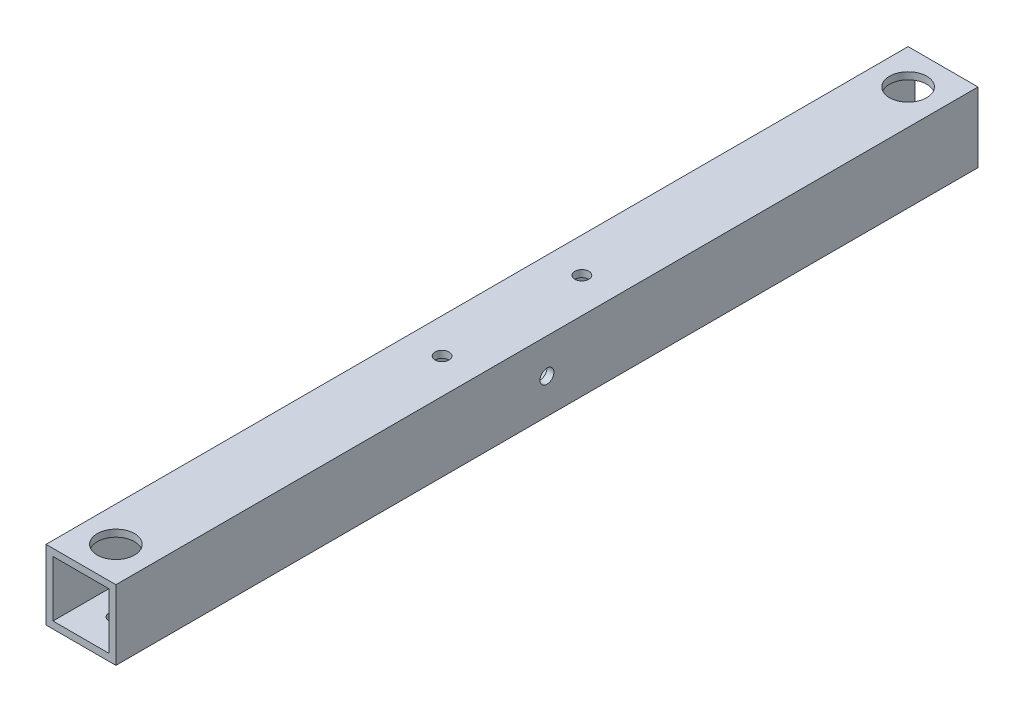
ISO-10303-21;
HEADER;
FILE_DESCRIPTION(('STEP AP214'),'2;1');
FILE_NAME('part.step','',(''),(''),'','','');
FILE_SCHEMA(('AUTOMOTIVE_DESIGN { 1 0 10303 214 1 1 1 1 }'));
ENDSEC;
DATA;
#1=APPLICATION_CONTEXT('core data for automotive mechanical design processes');
#2=APPLICATION_PROTOCOL_DEFINITION('international standard','automotive_design',2000,#1);
#3=PRODUCT_CONTEXT('',#1,'mechanical');
#4=PRODUCT('Part','Part','',(#3));
#5=PRODUCT_RELATED_PRODUCT_CATEGORY('part','',(#4));
#6=PRODUCT_DEFINITION_FORMATION('','',#4);
#7=PRODUCT_DEFINITION_CONTEXT('part definition',#1,'design');
#8=PRODUCT_DEFINITION('design','',#6,#7);
#9=PRODUCT_DEFINITION_SHAPE('','',#8);
#10=(LENGTH_UNIT() NAMED_UNIT(*) SI_UNIT(.MILLI.,.METRE.));
#11=(NAMED_UNIT(*) PLANE_ANGLE_UNIT() SI_UNIT($,.RADIAN.));
#12=(NAMED_UNIT(*) SI_UNIT($,.STERADIAN.) SOLID_ANGLE_UNIT());
#13=UNCERTAINTY_MEASURE_WITH_UNIT(LENGTH_MEASURE(1.E-05),#10,'distance_accuracy_value','');
#14=(GEOMETRIC_REPRESENTATION_CONTEXT(3) GLOBAL_UNCERTAINTY_ASSIGNED_CONTEXT((#13)) GLOBAL_UNIT_ASSIGNED_CONTEXT((#10,
#11,#12)) REPRESENTATION_CONTEXT('',''));
#15=CARTESIAN_POINT('',(0.,0.,0.));
#16=DIRECTION('',(0.,0.,1.));
#17=DIRECTION('',(1.,0.,0.));
#18=AXIS2_PLACEMENT_3D('',#15,#16,#17);
#19=CARTESIAN_POINT('',(0.,0.,185.));
#20=DIRECTION('',(0.,0.,1.));
#21=DIRECTION('',(1.,0.,0.));
#22=AXIS2_PLACEMENT_3D('',#19,#20,#21);
#23=PLANE('',#22);
#24=DIRECTION('',(0.,-1.,0.));
#25=VECTOR('',#24,1.);
#26=CARTESIAN_POINT('',(-7.01008414074451,7.73262608579252,185.));
#27=LINE('',#26,#25);
#28=CARTESIAN_POINT('',(-7.01008414074451,7.73262608579252,185.));
#29=VERTEX_POINT('',#28);
#30=CARTESIAN_POINT('',(-7.01008414074451,-7.26737391420748,185.));
#31=VERTEX_POINT('',#30);
#32=EDGE_CURVE('E139',#29,#31,#27,.T.);
#33=ORIENTED_EDGE('',*,*,#32,.T.);
#34=DIRECTION('',(1.,0.,0.));
#35=VECTOR('',#34,1.);
#36=CARTESIAN_POINT('',(-7.01008414074451,-7.26737391420748,185.));
#37=LINE('',#36,#35);
#38=CARTESIAN_POINT('',(7.98991585925548,-7.26737391420748,185.));
#39=VERTEX_POINT('',#38);
#40=EDGE_CURVE('E142',#31,#39,#37,.T.);
#41=ORIENTED_EDGE('',*,*,#40,.T.);
#42=DIRECTION('',(0.,1.,0.));
#43=VECTOR('',#42,1.);
#44=CARTESIAN_POINT('',(7.98991585925549,7.73262608579252,185.));
#45=LINE('',#44,#43);
#46=CARTESIAN_POINT('',(7.98991585925549,7.73262608579252,185.));
#47=VERTEX_POINT('',#46);
#48=EDGE_CURVE('E145',#39,#47,#45,.T.);
#49=ORIENTED_EDGE('',*,*,#48,.T.);
#50=DIRECTION('',(-1.,0.,0.));
#51=VECTOR('',#50,1.);
#52=CARTESIAN_POINT('',(-7.01008414074451,7.73262608579252,185.));
#53=LINE('',#52,#51);
#54=EDGE_CURVE('E147',#47,#29,#53,.T.);
#55=ORIENTED_EDGE('',*,*,#54,.T.);
#56=EDGE_LOOP('',(#33,#41,#49,#55));
#57=FACE_BOUND('',#56,.T.);
#58=DIRECTION('',(1.,0.,0.));
#59=VECTOR('',#58,1.);
#60=CARTESIAN_POINT('',(-5.51008414074451,-5.76737391420748,185.));
#61=LINE('',#60,#59);
#62=CARTESIAN_POINT('',(-5.51008414074451,-5.76737391420748,185.));
#63=VERTEX_POINT('',#62);
#64=CARTESIAN_POINT('',(6.48991585925549,-5.76737391420748,185.));
#65=VERTEX_POINT('',#64);
#66=EDGE_CURVE('E109',#63,#65,#61,.T.);
#67=ORIENTED_EDGE('',*,*,#66,.F.);
#68=DIRECTION('',(0.,-1.,0.));
#69=VECTOR('',#68,1.);
#70=CARTESIAN_POINT('',(-5.51008414074451,6.23262608579252,185.));
#71=LINE('',#70,#69);
#72=CARTESIAN_POINT('',(-5.51008414074451,6.23262608579252,185.));
#73=VERTEX_POINT('',#72);
#74=EDGE_CURVE('E101',#73,#63,#71,.T.);
#75=ORIENTED_EDGE('',*,*,#74,.F.);
#76=DIRECTION('',(-1.,0.,0.));
#77=VECTOR('',#76,1.);
#78=CARTESIAN_POINT('',(-5.51008414074451,6.23262608579252,185.));
#79=LINE('',#78,#77);
#80=CARTESIAN_POINT('',(6.48991585925549,6.23262608579252,185.));
#81=VERTEX_POINT('',#80);
#82=EDGE_CURVE('E123',#81,#73,#79,.T.);
#83=ORIENTED_EDGE('',*,*,#82,.F.);
#84=DIRECTION('',(0.,1.,0.));
#85=VECTOR('',#84,1.);
#86=CARTESIAN_POINT('',(6.48991585925549,6.23262608579252,185.));
#87=LINE('',#86,#85);
#88=EDGE_CURVE('E121',#65,#81,#87,.T.);
#89=ORIENTED_EDGE('',*,*,#88,.F.);
#90=EDGE_LOOP('',(#67,#75,#83,#89));
#91=FACE_BOUND('',#90,.T.);
#92=ADVANCED_FACE('F34',(#57,#91),#23,.T.);
#93=CARTESIAN_POINT('',(0.,0.,0.));
#94=DIRECTION('',(0.,0.,1.));
#95=DIRECTION('',(1.,0.,0.));
#96=AXIS2_PLACEMENT_3D('',#93,#94,#95);
#97=PLANE('',#96);
#98=DIRECTION('',(0.,-1.,0.));
#99=VECTOR('',#98,1.);
#100=CARTESIAN_POINT('',(-7.01008414074451,7.73262608579252,0.));
#101=LINE('',#100,#99);
#102=CARTESIAN_POINT('',(-7.01008414074451,7.73262608579252,0.));
#103=VERTEX_POINT('',#102);
#104=CARTESIAN_POINT('',(-7.01008414074451,-7.26737391420748,0.));
#105=VERTEX_POINT('',#104);
#106=EDGE_CURVE('E117',#103,#105,#101,.T.);
#107=ORIENTED_EDGE('',*,*,#106,.F.);
#108=DIRECTION('',(-1.,0.,0.));
#109=VECTOR('',#108,1.);
#110=CARTESIAN_POINT('',(-7.01008414074451,7.73262608579252,0.));
#111=LINE('',#110,#109);
#112=CARTESIAN_POINT('',(7.98991585925549,7.73262608579252,0.));
#113=VERTEX_POINT('',#112);
#114=EDGE_CURVE('E143',#113,#103,#111,.T.);
#115=ORIENTED_EDGE('',*,*,#114,.F.);
#116=DIRECTION('',(0.,1.,0.));
#117=VECTOR('',#116,1.);
#118=CARTESIAN_POINT('',(7.98991585925549,7.73262608579252,0.));
#119=LINE('',#118,#117);
#120=CARTESIAN_POINT('',(7.98991585925548,-7.26737391420748,0.));
#121=VERTEX_POINT('',#120);
#122=EDGE_CURVE('E154',#121,#113,#119,.T.);
#123=ORIENTED_EDGE('',*,*,#122,.F.);
#124=DIRECTION('',(1.,0.,0.));
#125=VECTOR('',#124,1.);
#126=CARTESIAN_POINT('',(-7.01008414074451,-7.26737391420748,0.));
#127=LINE('',#126,#125);
#128=EDGE_CURVE('E152',#105,#121,#127,.T.);
#129=ORIENTED_EDGE('',*,*,#128,.F.);
#130=EDGE_LOOP('',(#107,#115,#123,#129));
#131=FACE_BOUND('',#130,.T.);
#132=DIRECTION('',(0.,-1.,0.));
#133=VECTOR('',#132,1.);
#134=CARTESIAN_POINT('',(-5.51008414074451,6.23262608579252,0.));
#135=LINE('',#134,#133);
#136=CARTESIAN_POINT('',(-5.51008414074451,6.23262608579252,0.));
#137=VERTEX_POINT('',#136);
#138=CARTESIAN_POINT('',(-5.51008414074451,-5.76737391420748,0.));
#139=VERTEX_POINT('',#138);
#140=EDGE_CURVE('E59',#137,#139,#135,.T.);
#141=ORIENTED_EDGE('',*,*,#140,.T.);
#142=DIRECTION('',(1.,0.,0.));
#143=VECTOR('',#142,1.);
#144=CARTESIAN_POINT('',(-5.51008414074451,-5.76737391420748,0.));
#145=LINE('',#144,#143);
#146=CARTESIAN_POINT('',(6.48991585925549,-5.76737391420748,0.));
#147=VERTEX_POINT('',#146);
#148=EDGE_CURVE('E116',#139,#147,#145,.T.);
#149=ORIENTED_EDGE('',*,*,#148,.T.);
#150=DIRECTION('',(0.,1.,0.));
#151=VECTOR('',#150,1.);
#152=CARTESIAN_POINT('',(6.48991585925549,6.23262608579252,0.));
#153=LINE('',#152,#151);
#154=CARTESIAN_POINT('',(6.48991585925549,6.23262608579252,0.));
#155=VERTEX_POINT('',#154);
#156=EDGE_CURVE('E131',#147,#155,#153,.T.);
#157=ORIENTED_EDGE('',*,*,#156,.T.);
#158=DIRECTION('',(-1.,0.,0.));
#159=VECTOR('',#158,1.);
#160=CARTESIAN_POINT('',(-5.51008414074451,6.23262608579252,0.));
#161=LINE('',#160,#159);
#162=EDGE_CURVE('E110',#155,#137,#161,.T.);
#163=ORIENTED_EDGE('',*,*,#162,.T.);
#164=EDGE_LOOP('',(#141,#149,#157,#163));
#165=FACE_BOUND('',#164,.T.);
#166=ADVANCED_FACE('F241',(#131,#165),#97,.F.);
#167=CARTESIAN_POINT('',(-7.01008414074451,7.73262608579252,185.));
#168=DIRECTION('',(1.,0.,0.));
#169=DIRECTION('',(0.,1.,0.));
#170=AXIS2_PLACEMENT_3D('',#167,#168,#169);
#171=PLANE('',#170);
#172=CARTESIAN_POINT('',(-7.01008414074451,0.232626085792502,92.5));
#173=DIRECTION('',(-1.,0.,0.));
#174=DIRECTION('',(0.,-1.,0.));
#175=AXIS2_PLACEMENT_3D('',#172,#173,#174);
#176=CIRCLE('',#175,4.00000000000001);
#177=CARTESIAN_POINT('',(-7.01008414074451,-3.7673739142075,92.5));
#178=VERTEX_POINT('',#177);
#179=EDGE_CURVE('E206',#178,#178,#176,.T.);
#180=ORIENTED_EDGE('',*,*,#179,.F.);
#181=EDGE_LOOP('',(#180));
#182=FACE_BOUND('',#181,.T.);
#183=ORIENTED_EDGE('',*,*,#106,.T.);
#184=DIRECTION('',(0.,0.,-1.));
#185=VECTOR('',#184,1.);
#186=CARTESIAN_POINT('',(-7.01008414074451,-7.26737391420748,185.));
#187=LINE('',#186,#185);
#188=EDGE_CURVE('E11',#31,#105,#187,.T.);
#189=ORIENTED_EDGE('',*,*,#188,.F.);
#190=ORIENTED_EDGE('',*,*,#32,.F.);
#191=DIRECTION('',(0.,0.,-1.));
#192=VECTOR('',#191,1.);
#193=CARTESIAN_POINT('',(-7.01008414074451,7.73262608579252,185.));
#194=LINE('',#193,#192);
#195=EDGE_CURVE('E149',#29,#103,#194,.T.);
#196=ORIENTED_EDGE('',*,*,#195,.T.);
#197=EDGE_LOOP('',(#183,#189,#190,#196));
#198=FACE_BOUND('',#197,.T.);
#199=ADVANCED_FACE('F36',(#182,#198),#171,.F.);
#200=CARTESIAN_POINT('',(-7.01008414074451,-7.26737391420748,185.));
#201=DIRECTION('',(0.,1.,0.));
#202=DIRECTION('',(0.,0.,1.));
#203=AXIS2_PLACEMENT_3D('',#200,#201,#202);
#204=PLANE('',#203);
#205=CARTESIAN_POINT('',(0.489915859255476,-7.26737391420748,107.5));
#206=DIRECTION('',(0.,-1.,0.));
#207=DIRECTION('',(0.,0.,-1.));
#208=AXIS2_PLACEMENT_3D('',#205,#206,#207);
#209=CIRCLE('',#208,4.);
#210=CARTESIAN_POINT('',(0.489915859255476,-7.26737391420748,103.5));
#211=VERTEX_POINT('',#210);
#212=EDGE_CURVE('E193',#211,#211,#209,.T.);
#213=ORIENTED_EDGE('',*,*,#212,.F.);
#214=EDGE_LOOP('',(#213));
#215=FACE_BOUND('',#214,.T.);
#216=CARTESIAN_POINT('',(0.489915859255473,-7.26737391420748,77.5));
#217=DIRECTION('',(0.,-1.,0.));
#218=DIRECTION('',(0.,0.,-1.));
#219=AXIS2_PLACEMENT_3D('',#216,#217,#218);
#220=CIRCLE('',#219,4.);
#221=CARTESIAN_POINT('',(0.489915859255473,-7.26737391420748,73.5));
#222=VERTEX_POINT('',#221);
#223=EDGE_CURVE('E190',#222,#222,#220,.T.);
#224=ORIENTED_EDGE('',*,*,#223,.F.);
#225=EDGE_LOOP('',(#224));
#226=FACE_BOUND('',#225,.T.);
#227=CARTESIAN_POINT('',(0.489915859255484,-7.26737391420748,177.5));
#228=DIRECTION('',(0.,-1.,0.));
#229=DIRECTION('',(0.,0.,-1.));
#230=AXIS2_PLACEMENT_3D('',#227,#228,#229);
#231=CIRCLE('',#230,1.5);
#232=CARTESIAN_POINT('',(0.489915859255484,-7.26737391420748,176.));
#233=VERTEX_POINT('',#232);
#234=EDGE_CURVE('E178',#233,#233,#231,.T.);
#235=ORIENTED_EDGE('',*,*,#234,.F.);
#236=EDGE_LOOP('',(#235));
#237=FACE_BOUND('',#236,.T.);
#238=CARTESIAN_POINT('',(0.489915859255484,-7.26737391420748,7.5));
#239=DIRECTION('',(0.,-1.,0.));
#240=DIRECTION('',(0.,0.,-1.));
#241=AXIS2_PLACEMENT_3D('',#238,#239,#240);
#242=CIRCLE('',#241,1.5);
#243=CARTESIAN_POINT('',(0.489915859255484,-7.26737391420748,6.));
#244=VERTEX_POINT('',#243);
#245=EDGE_CURVE('E174',#244,#244,#242,.T.);
#246=ORIENTED_EDGE('',*,*,#245,.F.);
#247=EDGE_LOOP('',(#246));
#248=FACE_BOUND('',#247,.T.);
#249=ORIENTED_EDGE('',*,*,#128,.T.);
#250=DIRECTION('',(0.,0.,-1.));
#251=VECTOR('',#250,1.);
#252=CARTESIAN_POINT('',(7.98991585925548,-7.26737391420748,185.));
#253=LINE('',#252,#251);
#254=EDGE_CURVE('E43',#39,#121,#253,.T.);
#255=ORIENTED_EDGE('',*,*,#254,.F.);
#256=ORIENTED_EDGE('',*,*,#40,.F.);
#257=ORIENTED_EDGE('',*,*,#188,.T.);
#258=EDGE_LOOP('',(#249,#255,#256,#257));
#259=FACE_BOUND('',#258,.T.);
#260=ADVANCED_FACE('F245',(#215,#226,#237,#248,#259),#204,.F.);
#261=CARTESIAN_POINT('',(7.98991585925549,7.73262608579252,185.));
#262=DIRECTION('',(-1.,0.,0.));
#263=DIRECTION('',(0.,-1.,0.));
#264=AXIS2_PLACEMENT_3D('',#261,#262,#263);
#265=PLANE('',#264);
#266=CARTESIAN_POINT('',(7.98991585925548,0.232626085792525,92.5));
#267=DIRECTION('',(1.,0.,0.));
#268=DIRECTION('',(0.,1.,0.));
#269=AXIS2_PLACEMENT_3D('',#266,#267,#268);
#270=CIRCLE('',#269,1.5);
#271=CARTESIAN_POINT('',(7.98991585925548,1.73262608579252,92.5));
#272=VERTEX_POINT('',#271);
#273=EDGE_CURVE('E196',#272,#272,#270,.T.);
#274=ORIENTED_EDGE('',*,*,#273,.F.);
#275=EDGE_LOOP('',(#274));
#276=FACE_BOUND('',#275,.T.);
#277=ORIENTED_EDGE('',*,*,#122,.T.);
#278=DIRECTION('',(0.,0.,-1.));
#279=VECTOR('',#278,1.);
#280=CARTESIAN_POINT('',(7.98991585925549,7.73262608579252,185.));
#281=LINE('',#280,#279);
#282=EDGE_CURVE('E159',#47,#113,#281,.T.);
#283=ORIENTED_EDGE('',*,*,#282,.F.);
#284=ORIENTED_EDGE('',*,*,#48,.F.);
#285=ORIENTED_EDGE('',*,*,#254,.T.);
#286=EDGE_LOOP('',(#277,#283,#284,#285));
#287=FACE_BOUND('',#286,.T.);
#288=ADVANCED_FACE('F228',(#276,#287),#265,.F.);
#289=CARTESIAN_POINT('',(-7.01008414074451,7.73262608579252,185.));
#290=DIRECTION('',(0.,-1.,0.));
#291=DIRECTION('',(0.,0.,-1.));
#292=AXIS2_PLACEMENT_3D('',#289,#290,#291);
#293=PLANE('',#292);
#294=CARTESIAN_POINT('',(0.489915859255486,7.73262608579252,107.5));
#295=DIRECTION('',(0.,1.,0.));
#296=DIRECTION('',(0.,0.,1.));
#297=AXIS2_PLACEMENT_3D('',#294,#295,#296);
#298=CIRCLE('',#297,1.5);
#299=CARTESIAN_POINT('',(0.489915859255486,7.73262608579252,109.));
#300=VERTEX_POINT('',#299);
#301=EDGE_CURVE('E186',#300,#300,#298,.T.);
#302=ORIENTED_EDGE('',*,*,#301,.F.);
#303=EDGE_LOOP('',(#302));
#304=FACE_BOUND('',#303,.T.);
#305=CARTESIAN_POINT('',(0.489915859255467,7.73262608579252,77.5));
#306=DIRECTION('',(0.,1.,0.));
#307=DIRECTION('',(0.,0.,1.));
#308=AXIS2_PLACEMENT_3D('',#305,#306,#307);
#309=CIRCLE('',#308,1.5);
#310=CARTESIAN_POINT('',(0.489915859255467,7.73262608579252,79.));
#311=VERTEX_POINT('',#310);
#312=EDGE_CURVE('E182',#311,#311,#309,.T.);
#313=ORIENTED_EDGE('',*,*,#312,.F.);
#314=EDGE_LOOP('',(#313));
#315=FACE_BOUND('',#314,.T.);
#316=CARTESIAN_POINT('',(0.489915859255487,7.73262608579252,177.5));
#317=DIRECTION('',(0.,1.,0.));
#318=DIRECTION('',(0.,0.,1.));
#319=AXIS2_PLACEMENT_3D('',#316,#317,#318);
#320=CIRCLE('',#319,4.);
#321=CARTESIAN_POINT('',(0.489915859255487,7.73262608579252,181.5));
#322=VERTEX_POINT('',#321);
#323=EDGE_CURVE('E170',#322,#322,#320,.T.);
#324=ORIENTED_EDGE('',*,*,#323,.F.);
#325=EDGE_LOOP('',(#324));
#326=FACE_BOUND('',#325,.T.);
#327=CARTESIAN_POINT('',(0.489915859255487,7.73262608579252,7.5));
#328=DIRECTION('',(0.,1.,0.));
#329=DIRECTION('',(0.,0.,1.));
#330=AXIS2_PLACEMENT_3D('',#327,#328,#329);
#331=CIRCLE('',#330,4.);
#332=CARTESIAN_POINT('',(0.489915859255487,7.73262608579252,11.5));
#333=VERTEX_POINT('',#332);
#334=EDGE_CURVE('E166',#333,#333,#331,.T.);
#335=ORIENTED_EDGE('',*,*,#334,.F.);
#336=EDGE_LOOP('',(#335));
#337=FACE_BOUND('',#336,.T.);
#338=ORIENTED_EDGE('',*,*,#114,.T.);
#339=ORIENTED_EDGE('',*,*,#195,.F.);
#340=ORIENTED_EDGE('',*,*,#54,.F.);
#341=ORIENTED_EDGE('',*,*,#282,.T.);
#342=EDGE_LOOP('',(#338,#339,#340,#341));
#343=FACE_BOUND('',#342,.T.);
#344=ADVANCED_FACE('F225',(#304,#315,#326,#337,#343),#293,.F.);
#345=CARTESIAN_POINT('',(-5.51008414074451,6.23262608579252,185.));
#346=DIRECTION('',(1.,0.,0.));
#347=DIRECTION('',(0.,1.,0.));
#348=AXIS2_PLACEMENT_3D('',#345,#346,#347);
#349=PLANE('',#348);
#350=CARTESIAN_POINT('',(-5.51008414074451,0.232626085792502,92.5));
#351=DIRECTION('',(1.,0.,0.));
#352=DIRECTION('',(0.,1.,0.));
#353=AXIS2_PLACEMENT_3D('',#350,#351,#352);
#354=CIRCLE('',#353,4.00000000000001);
#355=CARTESIAN_POINT('',(-5.51008414074451,4.23262608579251,92.5));
#356=VERTEX_POINT('',#355);
#357=EDGE_CURVE('E38',#356,#356,#354,.T.);
#358=ORIENTED_EDGE('',*,*,#357,.F.);
#359=EDGE_LOOP('',(#358));
#360=FACE_BOUND('',#359,.T.);
#361=ORIENTED_EDGE('',*,*,#140,.F.);
#362=DIRECTION('',(0.,0.,-1.));
#363=VECTOR('',#362,1.);
#364=CARTESIAN_POINT('',(-5.51008414074451,6.23262608579252,185.));
#365=LINE('',#364,#363);
#366=EDGE_CURVE('E105',#73,#137,#365,.T.);
#367=ORIENTED_EDGE('',*,*,#366,.F.);
#368=ORIENTED_EDGE('',*,*,#74,.T.);
#369=DIRECTION('',(0.,0.,-1.));
#370=VECTOR('',#369,1.);
#371=CARTESIAN_POINT('',(-5.51008414074451,-5.76737391420748,185.));
#372=LINE('',#371,#370);
#373=EDGE_CURVE('E104',#63,#139,#372,.T.);
#374=ORIENTED_EDGE('',*,*,#373,.T.);
#375=EDGE_LOOP('',(#361,#367,#368,#374));
#376=FACE_BOUND('',#375,.T.);
#377=ADVANCED_FACE('F103',(#360,#376),#349,.T.);
#378=CARTESIAN_POINT('',(-5.51008414074451,-5.76737391420748,185.));
#379=DIRECTION('',(0.,1.,0.));
#380=DIRECTION('',(0.,0.,1.));
#381=AXIS2_PLACEMENT_3D('',#378,#379,#380);
#382=PLANE('',#381);
#383=CARTESIAN_POINT('',(0.489915859255476,-5.76737391420748,107.5));
#384=DIRECTION('',(0.,1.,0.));
#385=DIRECTION('',(0.,0.,1.));
#386=AXIS2_PLACEMENT_3D('',#383,#384,#385);
#387=CIRCLE('',#386,4.);
#388=CARTESIAN_POINT('',(0.489915859255476,-5.76737391420748,111.5));
#389=VERTEX_POINT('',#388);
#390=EDGE_CURVE('E191',#389,#389,#387,.T.);
#391=ORIENTED_EDGE('',*,*,#390,.F.);
#392=EDGE_LOOP('',(#391));
#393=FACE_BOUND('',#392,.T.);
#394=CARTESIAN_POINT('',(0.489915859255473,-5.76737391420748,77.5));
#395=DIRECTION('',(0.,1.,0.));
#396=DIRECTION('',(0.,0.,1.));
#397=AXIS2_PLACEMENT_3D('',#394,#395,#396);
#398=CIRCLE('',#397,4.);
#399=CARTESIAN_POINT('',(0.489915859255473,-5.76737391420748,81.5));
#400=VERTEX_POINT('',#399);
#401=EDGE_CURVE('E187',#400,#400,#398,.T.);
#402=ORIENTED_EDGE('',*,*,#401,.F.);
#403=EDGE_LOOP('',(#402));
#404=FACE_BOUND('',#403,.T.);
#405=CARTESIAN_POINT('',(0.489915859255484,-5.76737391420748,177.5));
#406=DIRECTION('',(0.,1.,0.));
#407=DIRECTION('',(0.,0.,1.));
#408=AXIS2_PLACEMENT_3D('',#405,#406,#407);
#409=CIRCLE('',#408,1.5);
#410=CARTESIAN_POINT('',(0.489915859255484,-5.76737391420748,179.));
#411=VERTEX_POINT('',#410);
#412=EDGE_CURVE('E175',#411,#411,#409,.T.);
#413=ORIENTED_EDGE('',*,*,#412,.F.);
#414=EDGE_LOOP('',(#413));
#415=FACE_BOUND('',#414,.T.);
#416=CARTESIAN_POINT('',(0.489915859255484,-5.76737391420748,7.5));
#417=DIRECTION('',(0.,1.,0.));
#418=DIRECTION('',(0.,0.,1.));
#419=AXIS2_PLACEMENT_3D('',#416,#417,#418);
#420=CIRCLE('',#419,1.5);
#421=CARTESIAN_POINT('',(0.489915859255484,-5.76737391420748,9.));
#422=VERTEX_POINT('',#421);
#423=EDGE_CURVE('E171',#422,#422,#420,.T.);
#424=ORIENTED_EDGE('',*,*,#423,.F.);
#425=EDGE_LOOP('',(#424));
#426=FACE_BOUND('',#425,.T.);
#427=ORIENTED_EDGE('',*,*,#148,.F.);
#428=ORIENTED_EDGE('',*,*,#373,.F.);
#429=ORIENTED_EDGE('',*,*,#66,.T.);
#430=DIRECTION('',(0.,0.,-1.));
#431=VECTOR('',#430,1.);
#432=CARTESIAN_POINT('',(6.48991585925549,-5.76737391420748,185.));
#433=LINE('',#432,#431);
#434=EDGE_CURVE('E118',#65,#147,#433,.T.);
#435=ORIENTED_EDGE('',*,*,#434,.T.);
#436=EDGE_LOOP('',(#427,#428,#429,#435));
#437=FACE_BOUND('',#436,.T.);
#438=ADVANCED_FACE('F113',(#393,#404,#415,#426,#437),#382,.T.);
#439=CARTESIAN_POINT('',(6.48991585925549,6.23262608579252,185.));
#440=DIRECTION('',(-1.,0.,0.));
#441=DIRECTION('',(0.,-1.,0.));
#442=AXIS2_PLACEMENT_3D('',#439,#440,#441);
#443=PLANE('',#442);
#444=CARTESIAN_POINT('',(6.48991585925549,0.232626085792525,92.5));
#445=DIRECTION('',(-1.,0.,0.));
#446=DIRECTION('',(0.,-1.,0.));
#447=AXIS2_PLACEMENT_3D('',#444,#445,#446);
#448=CIRCLE('',#447,1.5);
#449=CARTESIAN_POINT('',(6.48991585925549,-1.26737391420747,92.5));
#450=VERTEX_POINT('',#449);
#451=EDGE_CURVE('E194',#450,#450,#448,.T.);
#452=ORIENTED_EDGE('',*,*,#451,.F.);
#453=EDGE_LOOP('',(#452));
#454=FACE_BOUND('',#453,.T.);
#455=ORIENTED_EDGE('',*,*,#156,.F.);
#456=ORIENTED_EDGE('',*,*,#434,.F.);
#457=ORIENTED_EDGE('',*,*,#88,.T.);
#458=DIRECTION('',(0.,0.,-1.));
#459=VECTOR('',#458,1.);
#460=CARTESIAN_POINT('',(6.48991585925549,6.23262608579252,185.));
#461=LINE('',#460,#459);
#462=EDGE_CURVE('E51',#81,#155,#461,.T.);
#463=ORIENTED_EDGE('',*,*,#462,.T.);
#464=EDGE_LOOP('',(#455,#456,#457,#463));
#465=FACE_BOUND('',#464,.T.);
#466=ADVANCED_FACE('F268',(#454,#465),#443,.T.);
#467=CARTESIAN_POINT('',(-5.51008414074451,6.23262608579252,185.));
#468=DIRECTION('',(0.,-1.,0.));
#469=DIRECTION('',(0.,0.,-1.));
#470=AXIS2_PLACEMENT_3D('',#467,#468,#469);
#471=PLANE('',#470);
#472=CARTESIAN_POINT('',(0.489915859255486,6.23262608579252,107.5));
#473=DIRECTION('',(0.,-1.,0.));
#474=DIRECTION('',(0.,0.,-1.));
#475=AXIS2_PLACEMENT_3D('',#472,#473,#474);
#476=CIRCLE('',#475,1.5);
#477=CARTESIAN_POINT('',(0.489915859255486,6.23262608579252,106.));
#478=VERTEX_POINT('',#477);
#479=EDGE_CURVE('E183',#478,#478,#476,.T.);
#480=ORIENTED_EDGE('',*,*,#479,.F.);
#481=EDGE_LOOP('',(#480));
#482=FACE_BOUND('',#481,.T.);
#483=CARTESIAN_POINT('',(0.489915859255467,6.23262608579252,77.5));
#484=DIRECTION('',(0.,-1.,0.));
#485=DIRECTION('',(0.,0.,-1.));
#486=AXIS2_PLACEMENT_3D('',#483,#484,#485);
#487=CIRCLE('',#486,1.5);
#488=CARTESIAN_POINT('',(0.489915859255467,6.23262608579252,76.));
#489=VERTEX_POINT('',#488);
#490=EDGE_CURVE('E179',#489,#489,#487,.T.);
#491=ORIENTED_EDGE('',*,*,#490,.F.);
#492=EDGE_LOOP('',(#491));
#493=FACE_BOUND('',#492,.T.);
#494=CARTESIAN_POINT('',(0.489915859255487,6.23262608579252,177.5));
#495=DIRECTION('',(0.,-1.,0.));
#496=DIRECTION('',(0.,0.,-1.));
#497=AXIS2_PLACEMENT_3D('',#494,#495,#496);
#498=CIRCLE('',#497,4.);
#499=CARTESIAN_POINT('',(0.489915859255487,6.23262608579252,173.5));
#500=VERTEX_POINT('',#499);
#501=EDGE_CURVE('E167',#500,#500,#498,.T.);
#502=ORIENTED_EDGE('',*,*,#501,.F.);
#503=EDGE_LOOP('',(#502));
#504=FACE_BOUND('',#503,.T.);
#505=CARTESIAN_POINT('',(0.489915859255487,6.23262608579252,7.5));
#506=DIRECTION('',(0.,-1.,0.));
#507=DIRECTION('',(0.,0.,-1.));
#508=AXIS2_PLACEMENT_3D('',#505,#506,#507);
#509=CIRCLE('',#508,4.);
#510=CARTESIAN_POINT('',(0.489915859255487,6.23262608579252,3.5));
#511=VERTEX_POINT('',#510);
#512=EDGE_CURVE('E129',#511,#511,#509,.T.);
#513=ORIENTED_EDGE('',*,*,#512,.F.);
#514=EDGE_LOOP('',(#513));
#515=FACE_BOUND('',#514,.T.);
#516=ORIENTED_EDGE('',*,*,#162,.F.);
#517=ORIENTED_EDGE('',*,*,#462,.F.);
#518=ORIENTED_EDGE('',*,*,#82,.T.);
#519=ORIENTED_EDGE('',*,*,#366,.T.);
#520=EDGE_LOOP('',(#516,#517,#518,#519));
#521=FACE_BOUND('',#520,.T.);
#522=ADVANCED_FACE('F272',(#482,#493,#504,#515,#521),#471,.T.);
#523=CARTESIAN_POINT('',(0.489915859255487,-2.26737391420748,7.5));
#524=DIRECTION('',(0.,1.,0.));
#525=DIRECTION('',(0.,0.,1.));
#526=AXIS2_PLACEMENT_3D('',#523,#524,#525);
#527=CYLINDRICAL_SURFACE('',#526,4.);
#528=ORIENTED_EDGE('',*,*,#512,.T.);
#529=EDGE_LOOP('',(#528));
#530=FACE_BOUND('',#529,.T.);
#531=ORIENTED_EDGE('',*,*,#334,.T.);
#532=EDGE_LOOP('',(#531));
#533=FACE_BOUND('',#532,.T.);
#534=ADVANCED_FACE('F223',(#530,#533),#527,.F.);
#535=CARTESIAN_POINT('',(0.489915859255487,-2.26737391420748,177.5));
#536=DIRECTION('',(0.,1.,0.));
#537=DIRECTION('',(0.,0.,1.));
#538=AXIS2_PLACEMENT_3D('',#535,#536,#537);
#539=CYLINDRICAL_SURFACE('',#538,4.);
#540=ORIENTED_EDGE('',*,*,#501,.T.);
#541=EDGE_LOOP('',(#540));
#542=FACE_BOUND('',#541,.T.);
#543=ORIENTED_EDGE('',*,*,#323,.T.);
#544=EDGE_LOOP('',(#543));
#545=FACE_BOUND('',#544,.T.);
#546=ADVANCED_FACE('F279',(#542,#545),#539,.F.);
#547=CARTESIAN_POINT('',(0.489915859255484,2.73262608579252,7.5));
#548=DIRECTION('',(0.,-1.,0.));
#549=DIRECTION('',(0.,0.,-1.));
#550=AXIS2_PLACEMENT_3D('',#547,#548,#549);
#551=CYLINDRICAL_SURFACE('',#550,1.5);
#552=ORIENTED_EDGE('',*,*,#423,.T.);
#553=EDGE_LOOP('',(#552));
#554=FACE_BOUND('',#553,.T.);
#555=ORIENTED_EDGE('',*,*,#245,.T.);
#556=EDGE_LOOP('',(#555));
#557=FACE_BOUND('',#556,.T.);
#558=ADVANCED_FACE('F283',(#554,#557),#551,.F.);
#559=CARTESIAN_POINT('',(0.489915859255484,2.73262608579252,177.5));
#560=DIRECTION('',(0.,-1.,0.));
#561=DIRECTION('',(0.,0.,-1.));
#562=AXIS2_PLACEMENT_3D('',#559,#560,#561);
#563=CYLINDRICAL_SURFACE('',#562,1.5);
#564=ORIENTED_EDGE('',*,*,#412,.T.);
#565=EDGE_LOOP('',(#564));
#566=FACE_BOUND('',#565,.T.);
#567=ORIENTED_EDGE('',*,*,#234,.T.);
#568=EDGE_LOOP('',(#567));
#569=FACE_BOUND('',#568,.T.);
#570=ADVANCED_FACE('F287',(#566,#569),#563,.F.);
#571=CARTESIAN_POINT('',(0.489915859255467,-2.26737391420748,77.5));
#572=DIRECTION('',(0.,1.,0.));
#573=DIRECTION('',(0.,0.,1.));
#574=AXIS2_PLACEMENT_3D('',#571,#572,#573);
#575=CYLINDRICAL_SURFACE('',#574,1.5);
#576=ORIENTED_EDGE('',*,*,#490,.T.);
#577=EDGE_LOOP('',(#576));
#578=FACE_BOUND('',#577,.T.);
#579=ORIENTED_EDGE('',*,*,#312,.T.);
#580=EDGE_LOOP('',(#579));
#581=FACE_BOUND('',#580,.T.);
#582=ADVANCED_FACE('F291',(#578,#581),#575,.F.);
#583=CARTESIAN_POINT('',(0.489915859255486,-2.26737391420748,107.5));
#584=DIRECTION('',(0.,1.,0.));
#585=DIRECTION('',(0.,0.,1.));
#586=AXIS2_PLACEMENT_3D('',#583,#584,#585);
#587=CYLINDRICAL_SURFACE('',#586,1.5);
#588=ORIENTED_EDGE('',*,*,#479,.T.);
#589=EDGE_LOOP('',(#588));
#590=FACE_BOUND('',#589,.T.);
#591=ORIENTED_EDGE('',*,*,#301,.T.);
#592=EDGE_LOOP('',(#591));
#593=FACE_BOUND('',#592,.T.);
#594=ADVANCED_FACE('F295',(#590,#593),#587,.F.);
#595=CARTESIAN_POINT('',(0.489915859255473,2.73262608579252,77.5));
#596=DIRECTION('',(0.,-1.,0.));
#597=DIRECTION('',(0.,0.,-1.));
#598=AXIS2_PLACEMENT_3D('',#595,#596,#597);
#599=CYLINDRICAL_SURFACE('',#598,4.);
#600=ORIENTED_EDGE('',*,*,#401,.T.);
#601=EDGE_LOOP('',(#600));
#602=FACE_BOUND('',#601,.T.);
#603=ORIENTED_EDGE('',*,*,#223,.T.);
#604=EDGE_LOOP('',(#603));
#605=FACE_BOUND('',#604,.T.);
#606=ADVANCED_FACE('F299',(#602,#605),#599,.F.);
#607=CARTESIAN_POINT('',(0.489915859255476,2.73262608579252,107.5));
#608=DIRECTION('',(0.,-1.,0.));
#609=DIRECTION('',(0.,0.,-1.));
#610=AXIS2_PLACEMENT_3D('',#607,#608,#609);
#611=CYLINDRICAL_SURFACE('',#610,4.);
#612=ORIENTED_EDGE('',*,*,#390,.T.);
#613=EDGE_LOOP('',(#612));
#614=FACE_BOUND('',#613,.T.);
#615=ORIENTED_EDGE('',*,*,#212,.T.);
#616=EDGE_LOOP('',(#615));
#617=FACE_BOUND('',#616,.T.);
#618=ADVANCED_FACE('F303',(#614,#617),#611,.F.);
#619=CARTESIAN_POINT('',(-2.01008414074452,0.232626085792527,92.5));
#620=DIRECTION('',(1.,0.,0.));
#621=DIRECTION('',(0.,1.,0.));
#622=AXIS2_PLACEMENT_3D('',#619,#620,#621);
#623=CYLINDRICAL_SURFACE('',#622,1.5);
#624=ORIENTED_EDGE('',*,*,#451,.T.);
#625=EDGE_LOOP('',(#624));
#626=FACE_BOUND('',#625,.T.);
#627=ORIENTED_EDGE('',*,*,#273,.T.);
#628=EDGE_LOOP('',(#627));
#629=FACE_BOUND('',#628,.T.);
#630=ADVANCED_FACE('F307',(#626,#629),#623,.F.);
#631=CARTESIAN_POINT('',(2.98991585925549,0.232626085792503,92.5));
#632=DIRECTION('',(-1.,0.,0.));
#633=DIRECTION('',(0.,-1.,0.));
#634=AXIS2_PLACEMENT_3D('',#631,#632,#633);
#635=CYLINDRICAL_SURFACE('',#634,4.00000000000001);
#636=ORIENTED_EDGE('',*,*,#357,.T.);
#637=EDGE_LOOP('',(#636));
#638=FACE_BOUND('',#637,.T.);
#639=ORIENTED_EDGE('',*,*,#179,.T.);
#640=EDGE_LOOP('',(#639));
#641=FACE_BOUND('',#640,.T.);
#642=ADVANCED_FACE('F311',(#638,#641),#635,.F.);
#643=CLOSED_SHELL('',(#92,#166,#199,#260,#288,#344,#377,#438,#466,#522,#534,#546,#558,#570,#582,
#594,#606,#618,#630,#642));
#644=MANIFOLD_SOLID_BREP('B2',#643);
#645=ADVANCED_BREP_SHAPE_REPRESENTATION('',(#18,#644),#14);
#646=SHAPE_DEFINITION_REPRESENTATION(#9,#645);
ENDSEC;
END-ISO-10303-21;
